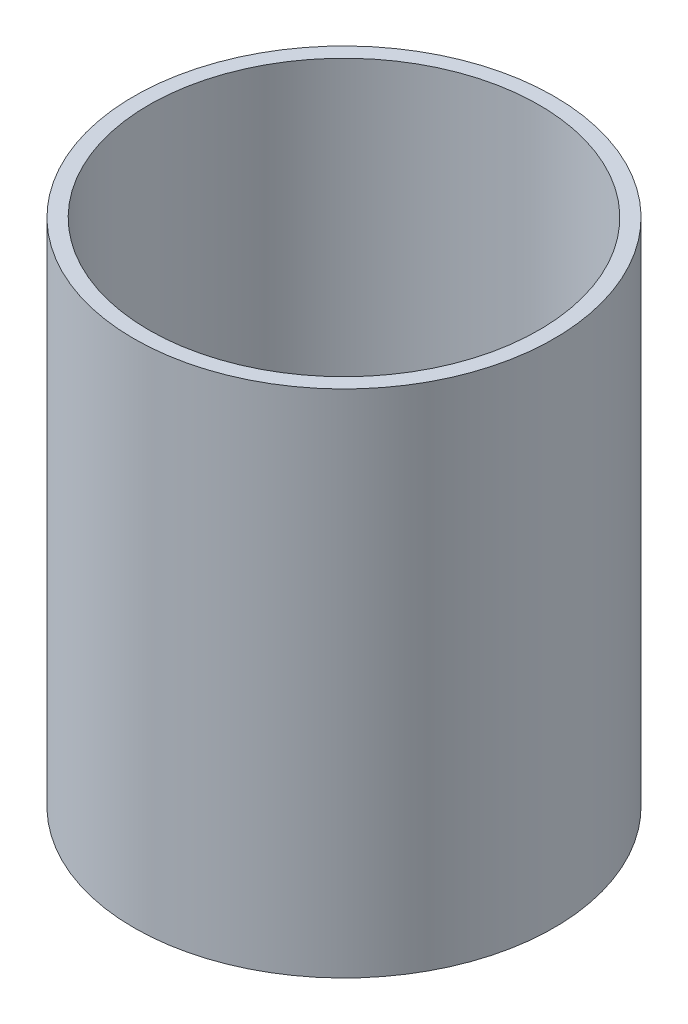
ISO-10303-21;
HEADER;
FILE_DESCRIPTION(('STEP AP214'),'2;1');
FILE_NAME('part.step','',(''),(''),'','','');
FILE_SCHEMA(('AUTOMOTIVE_DESIGN { 1 0 10303 214 1 1 1 1 }'));
ENDSEC;
DATA;
#1=APPLICATION_CONTEXT('core data for automotive mechanical design processes');
#2=APPLICATION_PROTOCOL_DEFINITION('international standard','automotive_design',2000,#1);
#3=PRODUCT_CONTEXT('',#1,'mechanical');
#4=PRODUCT('Part','Part','',(#3));
#5=PRODUCT_RELATED_PRODUCT_CATEGORY('part','',(#4));
#6=PRODUCT_DEFINITION_FORMATION('','',#4);
#7=PRODUCT_DEFINITION_CONTEXT('part definition',#1,'design');
#8=PRODUCT_DEFINITION('design','',#6,#7);
#9=PRODUCT_DEFINITION_SHAPE('','',#8);
#10=(LENGTH_UNIT() NAMED_UNIT(*) SI_UNIT(.MILLI.,.METRE.));
#11=(NAMED_UNIT(*) PLANE_ANGLE_UNIT() SI_UNIT($,.RADIAN.));
#12=(NAMED_UNIT(*) SI_UNIT($,.STERADIAN.) SOLID_ANGLE_UNIT());
#13=UNCERTAINTY_MEASURE_WITH_UNIT(LENGTH_MEASURE(1.E-05),#10,'distance_accuracy_value','');
#14=(GEOMETRIC_REPRESENTATION_CONTEXT(3) GLOBAL_UNCERTAINTY_ASSIGNED_CONTEXT((#13)) GLOBAL_UNIT_ASSIGNED_CONTEXT((#10,
#11,#12)) REPRESENTATION_CONTEXT('',''));
#15=CARTESIAN_POINT('',(0.,0.,0.));
#16=DIRECTION('',(0.,0.,1.));
#17=DIRECTION('',(1.,0.,0.));
#18=AXIS2_PLACEMENT_3D('',#15,#16,#17);
#19=CARTESIAN_POINT('',(0.,55.,0.));
#20=DIRECTION('',(0.,1.,0.));
#21=DIRECTION('',(0.,0.,1.));
#22=AXIS2_PLACEMENT_3D('',#19,#20,#21);
#23=CYLINDRICAL_SURFACE('',#22,44.45);
#24=CARTESIAN_POINT('',(0.,-70.9708966054068,0.));
#25=DIRECTION('',(0.,1.,0.));
#26=DIRECTION('',(0.,0.,1.));
#27=AXIS2_PLACEMENT_3D('',#24,#25,#26);
#28=CIRCLE('',#27,44.45);
#29=CARTESIAN_POINT('',(0.,-70.9708966054068,44.45));
#30=VERTEX_POINT('',#29);
#31=EDGE_CURVE('E12',#30,#30,#28,.T.);
#32=ORIENTED_EDGE('',*,*,#31,.T.);
#33=EDGE_LOOP('',(#32));
#34=FACE_BOUND('',#33,.T.);
#35=CARTESIAN_POINT('',(0.,36.9791033945932,0.));
#36=DIRECTION('',(0.,1.,0.));
#37=DIRECTION('',(0.,0.,1.));
#38=AXIS2_PLACEMENT_3D('',#35,#36,#37);
#39=CIRCLE('',#38,44.45);
#40=CARTESIAN_POINT('',(0.,36.9791033945932,44.45));
#41=VERTEX_POINT('',#40);
#42=EDGE_CURVE('E55',#41,#41,#39,.T.);
#43=ORIENTED_EDGE('',*,*,#42,.F.);
#44=EDGE_LOOP('',(#43));
#45=FACE_BOUND('',#44,.T.);
#46=ADVANCED_FACE('F41',(#34,#45),#23,.T.);
#47=CARTESIAN_POINT('',(-44.45,-70.9708966054068,0.));
#48=DIRECTION('',(0.,-1.,0.));
#49=DIRECTION('',(0.,0.,-1.));
#50=AXIS2_PLACEMENT_3D('',#47,#48,#49);
#51=PLANE('',#50);
#52=CARTESIAN_POINT('',(0.,-70.9708966054068,0.));
#53=DIRECTION('',(0.,1.,0.));
#54=DIRECTION('',(0.,0.,1.));
#55=AXIS2_PLACEMENT_3D('',#52,#53,#54);
#56=CIRCLE('',#55,41.275);
#57=CARTESIAN_POINT('',(0.,-70.9708966054068,41.275));
#58=VERTEX_POINT('',#57);
#59=EDGE_CURVE('E47',#58,#58,#56,.T.);
#60=ORIENTED_EDGE('',*,*,#59,.T.);
#61=EDGE_LOOP('',(#60));
#62=FACE_BOUND('',#61,.T.);
#63=ORIENTED_EDGE('',*,*,#31,.F.);
#64=EDGE_LOOP('',(#63));
#65=FACE_BOUND('',#64,.T.);
#66=ADVANCED_FACE('F65',(#62,#65),#51,.T.);
#67=CARTESIAN_POINT('',(0.,55.,0.));
#68=DIRECTION('',(0.,1.,0.));
#69=DIRECTION('',(0.,0.,1.));
#70=AXIS2_PLACEMENT_3D('',#67,#68,#69);
#71=CYLINDRICAL_SURFACE('',#70,41.275);
#72=CARTESIAN_POINT('',(0.,36.9791033945932,0.));
#73=DIRECTION('',(0.,1.,0.));
#74=DIRECTION('',(0.,0.,1.));
#75=AXIS2_PLACEMENT_3D('',#72,#73,#74);
#76=CIRCLE('',#75,41.275);
#77=CARTESIAN_POINT('',(0.,36.9791033945932,41.275));
#78=VERTEX_POINT('',#77);
#79=EDGE_CURVE('E51',#78,#78,#76,.T.);
#80=ORIENTED_EDGE('',*,*,#79,.T.);
#81=EDGE_LOOP('',(#80));
#82=FACE_BOUND('',#81,.T.);
#83=ORIENTED_EDGE('',*,*,#59,.F.);
#84=EDGE_LOOP('',(#83));
#85=FACE_BOUND('',#84,.T.);
#86=ADVANCED_FACE('F69',(#82,#85),#71,.F.);
#87=CARTESIAN_POINT('',(-44.45,36.9791033945932,0.));
#88=DIRECTION('',(0.,1.,0.));
#89=DIRECTION('',(0.,0.,1.));
#90=AXIS2_PLACEMENT_3D('',#87,#88,#89);
#91=PLANE('',#90);
#92=ORIENTED_EDGE('',*,*,#42,.T.);
#93=EDGE_LOOP('',(#92));
#94=FACE_BOUND('',#93,.T.);
#95=ORIENTED_EDGE('',*,*,#79,.F.);
#96=EDGE_LOOP('',(#95));
#97=FACE_BOUND('',#96,.T.);
#98=ADVANCED_FACE('F61',(#94,#97),#91,.T.);
#99=CLOSED_SHELL('',(#46,#66,#86,#98));
#100=MANIFOLD_SOLID_BREP('B2',#99);
#101=ADVANCED_BREP_SHAPE_REPRESENTATION('',(#18,#100),#14);
#102=SHAPE_DEFINITION_REPRESENTATION(#9,#101);
ENDSEC;
END-ISO-10303-21;
